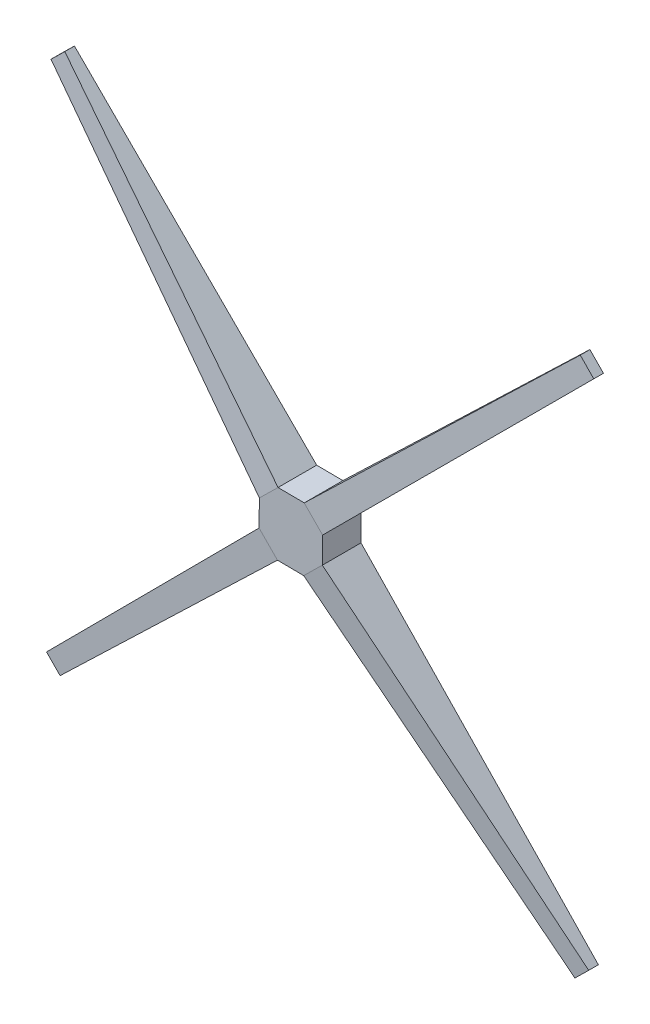
ISO-10303-21;
HEADER;
FILE_DESCRIPTION(('STEP AP214'),'2;1');
FILE_NAME('part.step','',(''),(''),'','','');
FILE_SCHEMA(('AUTOMOTIVE_DESIGN { 1 0 10303 214 1 1 1 1 }'));
ENDSEC;
DATA;
#1=APPLICATION_CONTEXT('core data for automotive mechanical design processes');
#2=APPLICATION_PROTOCOL_DEFINITION('international standard','automotive_design',2000,#1);
#3=PRODUCT_CONTEXT('',#1,'mechanical');
#4=PRODUCT('Part','Part','',(#3));
#5=PRODUCT_RELATED_PRODUCT_CATEGORY('part','',(#4));
#6=PRODUCT_DEFINITION_FORMATION('','',#4);
#7=PRODUCT_DEFINITION_CONTEXT('part definition',#1,'design');
#8=PRODUCT_DEFINITION('design','',#6,#7);
#9=PRODUCT_DEFINITION_SHAPE('','',#8);
#10=(LENGTH_UNIT() NAMED_UNIT(*) SI_UNIT(.MILLI.,.METRE.));
#11=(NAMED_UNIT(*) PLANE_ANGLE_UNIT() SI_UNIT($,.RADIAN.));
#12=(NAMED_UNIT(*) SI_UNIT($,.STERADIAN.) SOLID_ANGLE_UNIT());
#13=UNCERTAINTY_MEASURE_WITH_UNIT(LENGTH_MEASURE(1.E-05),#10,'distance_accuracy_value','');
#14=(GEOMETRIC_REPRESENTATION_CONTEXT(3) GLOBAL_UNCERTAINTY_ASSIGNED_CONTEXT((#13)) GLOBAL_UNIT_ASSIGNED_CONTEXT((#10,
#11,#12)) REPRESENTATION_CONTEXT('',''));
#15=CARTESIAN_POINT('',(0.,0.,0.));
#16=DIRECTION('',(0.,0.,1.));
#17=DIRECTION('',(1.,0.,0.));
#18=AXIS2_PLACEMENT_3D('',#15,#16,#17);
#19=CARTESIAN_POINT('',(-583.133216143367,41.4134818419812,50.8));
#20=DIRECTION('',(-0.00925150475711182,-0.999957203914112,0.));
#21=DIRECTION('',(0.999957203914112,-0.00925150475711182,0.));
#22=AXIS2_PLACEMENT_3D('',#19,#20,#21);
#23=PLANE('',#22);
#24=DIRECTION('',(-0.999957203914112,0.00925150475711182,0.));
#25=VECTOR('',#24,1.);
#26=CARTESIAN_POINT('',(-583.133216143367,41.4134818419812,0.));
#27=LINE('',#26,#25);
#28=CARTESIAN_POINT('',(-583.133216143367,41.4134818419812,0.));
#29=VERTEX_POINT('',#28);
#30=CARTESIAN_POINT('',(-617.573251094452,41.7321176255305,0.));
#31=VERTEX_POINT('',#30);
#32=EDGE_CURVE('E367',#29,#31,#27,.T.);
#33=ORIENTED_EDGE('',*,*,#32,.T.);
#34=DIRECTION('',(0.,0.,1.));
#35=VECTOR('',#34,1.);
#36=CARTESIAN_POINT('',(-617.573251094452,41.7321176255305,0.));
#37=LINE('',#36,#35);
#38=CARTESIAN_POINT('',(-617.573251094452,41.7321176255305,50.8));
#39=VERTEX_POINT('',#38);
#40=EDGE_CURVE('E89',#39,#31,#37,.F.);
#41=ORIENTED_EDGE('',*,*,#40,.F.);
#42=DIRECTION('',(-0.999957203914112,0.00925150475711182,0.));
#43=VECTOR('',#42,1.);
#44=CARTESIAN_POINT('',(-583.133216143367,41.4134818419812,50.8));
#45=LINE('',#44,#43);
#46=CARTESIAN_POINT('',(-583.133216143367,41.4134818419812,50.8));
#47=VERTEX_POINT('',#46);
#48=EDGE_CURVE('E134',#47,#39,#45,.T.);
#49=ORIENTED_EDGE('',*,*,#48,.F.);
#50=DIRECTION('',(0.,0.,1.));
#51=VECTOR('',#50,1.);
#52=CARTESIAN_POINT('',(-583.133216143367,41.4134818419812,50.8));
#53=LINE('',#52,#51);
#54=EDGE_CURVE('E12',#47,#29,#53,.F.);
#55=ORIENTED_EDGE('',*,*,#54,.T.);
#56=EDGE_LOOP('',(#33,#41,#49,#55));
#57=FACE_BOUND('',#56,.T.);
#58=ADVANCED_FACE('F79',(#57),#23,.F.);
#59=CARTESIAN_POINT('',(-642.151342875942,17.6046448905936,50.8));
#60=DIRECTION('',(0.999957203914112,-0.00925150475711144,0.));
#61=DIRECTION('',(0.00925150475711144,0.999957203914112,0.));
#62=AXIS2_PLACEMENT_3D('',#59,#60,#61);
#63=PLANE('',#62);
#64=DIRECTION('',(-0.00925150475711144,-0.999957203914112,0.));
#65=VECTOR('',#64,1.);
#66=CARTESIAN_POINT('',(-642.151342875942,17.6046448905936,0.));
#67=LINE('',#66,#65);
#68=CARTESIAN_POINT('',(-642.151342875942,17.6046448905936,0.));
#69=VERTEX_POINT('',#68);
#70=CARTESIAN_POINT('',(-642.469978659491,-16.835390060491,0.));
#71=VERTEX_POINT('',#70);
#72=EDGE_CURVE('E309',#69,#71,#67,.T.);
#73=ORIENTED_EDGE('',*,*,#72,.T.);
#74=DIRECTION('',(0.,0.,1.));
#75=VECTOR('',#74,1.);
#76=CARTESIAN_POINT('',(-642.469978659491,-16.835390060491,0.));
#77=LINE('',#76,#75);
#78=CARTESIAN_POINT('',(-642.469978659491,-16.835390060491,50.8));
#79=VERTEX_POINT('',#78);
#80=EDGE_CURVE('E383',#79,#71,#77,.F.);
#81=ORIENTED_EDGE('',*,*,#80,.F.);
#82=DIRECTION('',(-0.00925150475711144,-0.999957203914112,0.));
#83=VECTOR('',#82,1.);
#84=CARTESIAN_POINT('',(-642.151342875942,17.6046448905936,50.8));
#85=LINE('',#84,#83);
#86=CARTESIAN_POINT('',(-642.151342875942,17.6046448905936,50.8));
#87=VERTEX_POINT('',#86);
#88=EDGE_CURVE('E373',#87,#79,#85,.T.);
#89=ORIENTED_EDGE('',*,*,#88,.F.);
#90=DIRECTION('',(0.,0.,1.));
#91=VECTOR('',#90,1.);
#92=CARTESIAN_POINT('',(-642.151342875942,17.6046448905936,50.8));
#93=LINE('',#92,#91);
#94=EDGE_CURVE('E219',#87,#69,#93,.F.);
#95=ORIENTED_EDGE('',*,*,#94,.T.);
#96=EDGE_LOOP('',(#73,#81,#89,#95));
#97=FACE_BOUND('',#96,.T.);
#98=ADVANCED_FACE('F381',(#97),#63,.F.);
#99=CARTESIAN_POINT('',(-618.342505924554,-41.4134818419811,50.8));
#100=DIRECTION('',(0.00925150475711182,0.999957203914112,0.));
#101=DIRECTION('',(-0.999957203914112,0.00925150475711182,0.));
#102=AXIS2_PLACEMENT_3D('',#99,#100,#101);
#103=PLANE('',#102);
#104=DIRECTION('',(0.999957203914112,-0.00925150475711182,0.));
#105=VECTOR('',#104,1.);
#106=CARTESIAN_POINT('',(-618.342505924554,-41.4134818419811,0.));
#107=LINE('',#106,#105);
#108=CARTESIAN_POINT('',(-618.342505924554,-41.4134818419811,0.));
#109=VERTEX_POINT('',#108);
#110=CARTESIAN_POINT('',(-583.902470973469,-41.7321176255305,0.));
#111=VERTEX_POINT('',#110);
#112=EDGE_CURVE('E685',#109,#111,#107,.T.);
#113=ORIENTED_EDGE('',*,*,#112,.T.);
#114=DIRECTION('',(0.,0.,1.));
#115=VECTOR('',#114,1.);
#116=CARTESIAN_POINT('',(-583.902470973469,-41.7321176255304,0.));
#117=LINE('',#116,#115);
#118=CARTESIAN_POINT('',(-583.902470973469,-41.7321176255305,50.8));
#119=VERTEX_POINT('',#118);
#120=EDGE_CURVE('E357',#119,#111,#117,.F.);
#121=ORIENTED_EDGE('',*,*,#120,.F.);
#122=DIRECTION('',(0.999957203914112,-0.00925150475711182,0.));
#123=VECTOR('',#122,1.);
#124=CARTESIAN_POINT('',(-618.342505924554,-41.4134818419811,50.8));
#125=LINE('',#124,#123);
#126=CARTESIAN_POINT('',(-618.342505924554,-41.4134818419811,50.8));
#127=VERTEX_POINT('',#126);
#128=EDGE_CURVE('E366',#127,#119,#125,.T.);
#129=ORIENTED_EDGE('',*,*,#128,.F.);
#130=DIRECTION('',(0.,0.,1.));
#131=VECTOR('',#130,1.);
#132=CARTESIAN_POINT('',(-618.342505924554,-41.4134818419811,50.8));
#133=LINE('',#132,#131);
#134=EDGE_CURVE('E362',#127,#109,#133,.F.);
#135=ORIENTED_EDGE('',*,*,#134,.T.);
#136=EDGE_LOOP('',(#113,#121,#129,#135));
#137=FACE_BOUND('',#136,.T.);
#138=ADVANCED_FACE('F643',(#137),#103,.F.);
#139=CARTESIAN_POINT('',(-559.324379191979,-17.6046448905934,50.8));
#140=DIRECTION('',(-0.999957203914112,0.00925150475711149,0.));
#141=DIRECTION('',(-0.00925150475711149,-0.999957203914112,0.));
#142=AXIS2_PLACEMENT_3D('',#139,#140,#141);
#143=PLANE('',#142);
#144=DIRECTION('',(0.00925150475711149,0.999957203914112,0.));
#145=VECTOR('',#144,1.);
#146=CARTESIAN_POINT('',(-559.324379191979,-17.6046448905934,0.));
#147=LINE('',#146,#145);
#148=CARTESIAN_POINT('',(-559.324379191979,-17.6046448905935,0.));
#149=VERTEX_POINT('',#148);
#150=CARTESIAN_POINT('',(-559.00574340843,16.8353900604909,0.));
#151=VERTEX_POINT('',#150);
#152=EDGE_CURVE('E683',#149,#151,#147,.T.);
#153=ORIENTED_EDGE('',*,*,#152,.T.);
#154=DIRECTION('',(0.,0.,1.));
#155=VECTOR('',#154,1.);
#156=CARTESIAN_POINT('',(-559.00574340843,16.8353900604909,0.));
#157=LINE('',#156,#155);
#158=CARTESIAN_POINT('',(-559.00574340843,16.835390060491,50.8));
#159=VERTEX_POINT('',#158);
#160=EDGE_CURVE('E358',#159,#151,#157,.F.);
#161=ORIENTED_EDGE('',*,*,#160,.F.);
#162=DIRECTION('',(0.00925150475711149,0.999957203914112,0.));
#163=VECTOR('',#162,1.);
#164=CARTESIAN_POINT('',(-559.324379191979,-17.6046448905934,50.8));
#165=LINE('',#164,#163);
#166=CARTESIAN_POINT('',(-559.324379191979,-17.6046448905935,50.8));
#167=VERTEX_POINT('',#166);
#168=EDGE_CURVE('E98',#167,#159,#165,.T.);
#169=ORIENTED_EDGE('',*,*,#168,.F.);
#170=DIRECTION('',(0.,0.,1.));
#171=VECTOR('',#170,1.);
#172=CARTESIAN_POINT('',(-559.324379191979,-17.6046448905934,50.8));
#173=LINE('',#172,#171);
#174=EDGE_CURVE('E349',#167,#149,#173,.F.);
#175=ORIENTED_EDGE('',*,*,#174,.T.);
#176=EDGE_LOOP('',(#153,#161,#169,#175));
#177=FACE_BOUND('',#176,.T.);
#178=ADVANCED_FACE('F327',(#177),#143,.F.);
#179=CARTESIAN_POINT('',(0.,0.,50.8));
#180=DIRECTION('',(0.,0.,1.));
#181=DIRECTION('',(1.,0.,0.));
#182=AXIS2_PLACEMENT_3D('',#179,#180,#181);
#183=PLANE('',#182);
#184=DIRECTION('',(-0.700534718034074,0.713618321533942,0.));
#185=VECTOR('',#184,1.);
#186=CARTESIAN_POINT('',(-559.00574340843,16.8353900604911,50.8));
#187=LINE('',#186,#185);
#188=EDGE_CURVE('E372',#159,#47,#187,.T.);
#189=ORIENTED_EDGE('',*,*,#188,.T.);
#190=ORIENTED_EDGE('',*,*,#48,.T.);
#191=DIRECTION('',(-0.713618321533941,-0.700534718034075,0.));
#192=VECTOR('',#191,1.);
#193=CARTESIAN_POINT('',(-617.573251094452,41.7321176255306,50.8));
#194=LINE('',#193,#192);
#195=EDGE_CURVE('E82',#39,#87,#194,.T.);
#196=ORIENTED_EDGE('',*,*,#195,.T.);
#197=ORIENTED_EDGE('',*,*,#88,.T.);
#198=DIRECTION('',(0.700534718034074,-0.713618321533942,0.));
#199=VECTOR('',#198,1.);
#200=CARTESIAN_POINT('',(-642.469978659491,-16.8353900604911,50.8));
#201=LINE('',#200,#199);
#202=EDGE_CURVE('E375',#79,#127,#201,.T.);
#203=ORIENTED_EDGE('',*,*,#202,.T.);
#204=ORIENTED_EDGE('',*,*,#128,.T.);
#205=DIRECTION('',(0.713618321533942,0.700534718034074,0.));
#206=VECTOR('',#205,1.);
#207=CARTESIAN_POINT('',(-583.902470973469,-41.7321176255305,50.8));
#208=LINE('',#207,#206);
#209=EDGE_CURVE('E363',#119,#167,#208,.T.);
#210=ORIENTED_EDGE('',*,*,#209,.T.);
#211=ORIENTED_EDGE('',*,*,#168,.T.);
#212=EDGE_LOOP('',(#189,#190,#196,#197,#203,#204,#210,#211));
#213=FACE_BOUND('',#212,.T.);
#214=ADVANCED_FACE('F325',(#213),#183,.T.);
#215=CARTESIAN_POINT('',(0.,0.,0.));
#216=DIRECTION('',(0.,0.,1.));
#217=DIRECTION('',(1.,0.,0.));
#218=AXIS2_PLACEMENT_3D('',#215,#216,#217);
#219=PLANE('',#218);
#220=ORIENTED_EDGE('',*,*,#32,.F.);
#221=DIRECTION('',(0.721599332229077,0.692310915504407,0.));
#222=VECTOR('',#221,1.);
#223=CARTESIAN_POINT('',(-583.133216143367,41.4134818419811,0.));
#224=LINE('',#223,#222);
#225=CARTESIAN_POINT('',(-258.392192989741,352.97385198095,0.));
#226=VERTEX_POINT('',#225);
#227=EDGE_CURVE('E510',#29,#226,#224,.T.);
#228=ORIENTED_EDGE('',*,*,#227,.T.);
#229=DIRECTION('',(-0.700534718034074,0.713618321533942,0.));
#230=VECTOR('',#229,1.);
#231=CARTESIAN_POINT('',(-258.392192989741,352.97385198095,0.));
#232=LINE('',#231,#230);
#233=CARTESIAN_POINT('',(-240.598611151676,334.847946613988,0.));
#234=VERTEX_POINT('',#233);
#235=EDGE_CURVE('E505',#234,#226,#232,.T.);
#236=ORIENTED_EDGE('',*,*,#235,.F.);
#237=DIRECTION('',(0.7075450463998,0.706668244167732,0.));
#238=VECTOR('',#237,1.);
#239=CARTESIAN_POINT('',(-559.00574340843,16.8353900604909,0.));
#240=LINE('',#239,#238);
#241=EDGE_CURVE('E508',#151,#234,#240,.T.);
#242=ORIENTED_EDGE('',*,*,#241,.F.);
#243=ORIENTED_EDGE('',*,*,#152,.F.);
#244=DIRECTION('',(0.693395816134367,-0.72055689724501,0.));
#245=VECTOR('',#244,1.);
#246=CARTESIAN_POINT('',(-559.324379191979,-17.6046448905934,0.));
#247=LINE('',#246,#245);
#248=CARTESIAN_POINT('',(-247.280799016528,-341.871317265318,0.));
#249=VERTEX_POINT('',#248);
#250=EDGE_CURVE('E287',#149,#249,#247,.T.);
#251=ORIENTED_EDGE('',*,*,#250,.T.);
#252=DIRECTION('',(0.713618321533941,0.700534718034075,0.));
#253=VECTOR('',#252,1.);
#254=CARTESIAN_POINT('',(-247.280799016528,-341.871317265318,0.));
#255=LINE('',#254,#253);
#256=CARTESIAN_POINT('',(-265.40670438349,-359.664899103383,0.));
#257=VERTEX_POINT('',#256);
#258=EDGE_CURVE('E586',#257,#249,#255,.T.);
#259=ORIENTED_EDGE('',*,*,#258,.F.);
#260=DIRECTION('',(0.707732011403588,-0.706480997645819,0.));
#261=VECTOR('',#260,1.);
#262=CARTESIAN_POINT('',(-583.902470973469,-41.7321176255304,0.));
#263=LINE('',#262,#261);
#264=EDGE_CURVE('E237',#111,#257,#263,.T.);
#265=ORIENTED_EDGE('',*,*,#264,.F.);
#266=ORIENTED_EDGE('',*,*,#112,.F.);
#267=DIRECTION('',(-0.719638428667994,-0.694348998691767,0.));
#268=VECTOR('',#267,1.);
#269=CARTESIAN_POINT('',(-618.342505924554,-41.413481841981,0.));
#270=LINE('',#269,#268);
#271=CARTESIAN_POINT('',(-942.191862937023,-353.882171409867,0.));
#272=VERTEX_POINT('',#271);
#273=EDGE_CURVE('E405',#109,#272,#270,.T.);
#274=ORIENTED_EDGE('',*,*,#273,.T.);
#275=DIRECTION('',(0.700534718034074,-0.713618321533942,0.));
#276=VECTOR('',#275,1.);
#277=CARTESIAN_POINT('',(-942.191862937023,-353.882171409867,0.));
#278=LINE('',#277,#276);
#279=CARTESIAN_POINT('',(-959.985444775089,-335.756266042905,0.));
#280=VERTEX_POINT('',#279);
#281=EDGE_CURVE('E427',#280,#272,#278,.T.);
#282=ORIENTED_EDGE('',*,*,#281,.F.);
#283=DIRECTION('',(-0.7055435931574,-0.708666521118746,0.));
#284=VECTOR('',#283,1.);
#285=CARTESIAN_POINT('',(-642.469978659491,-16.835390060491,0.));
#286=LINE('',#285,#284);
#287=EDGE_CURVE('E406',#71,#280,#286,.T.);
#288=ORIENTED_EDGE('',*,*,#287,.F.);
#289=ORIENTED_EDGE('',*,*,#72,.F.);
#290=DIRECTION('',(-0.693265450029443,0.720682326545805,0.));
#291=VECTOR('',#290,1.);
#292=CARTESIAN_POINT('',(-642.151342875941,17.6046448905935,0.));
#293=LINE('',#292,#291);
#294=CARTESIAN_POINT('',(-954.136822407347,341.928352681963,0.));
#295=VERTEX_POINT('',#294);
#296=EDGE_CURVE('E302',#69,#295,#293,.T.);
#297=ORIENTED_EDGE('',*,*,#296,.T.);
#298=DIRECTION('',(-0.713618321533939,-0.700534718034077,0.));
#299=VECTOR('',#298,1.);
#300=CARTESIAN_POINT('',(-954.136822407347,341.928352681963,0.));
#301=LINE('',#300,#299);
#302=CARTESIAN_POINT('',(-936.010917040385,359.721934520029,0.));
#303=VERTEX_POINT('',#302);
#304=EDGE_CURVE('E226',#303,#295,#301,.T.);
#305=ORIENTED_EDGE('',*,*,#304,.F.);
#306=DIRECTION('',(-0.707604191511818,0.70660902071436,0.));
#307=VECTOR('',#306,1.);
#308=CARTESIAN_POINT('',(-617.573251094452,41.7321176255305,0.));
#309=LINE('',#308,#307);
#310=EDGE_CURVE('E221',#31,#303,#309,.T.);
#311=ORIENTED_EDGE('',*,*,#310,.F.);
#312=EDGE_LOOP('',(#220,#228,#236,#242,#243,#251,#259,#265,#266,#274,#282,#288,#289,#297,#305,#311));
#313=FACE_BOUND('',#312,.T.);
#314=ADVANCED_FACE('F305',(#313),#219,.F.);
#315=CARTESIAN_POINT('',(-656.723047739733,-644.682572170968,0.));
#316=DIRECTION('',(0.713618321533942,0.700534718034074,0.));
#317=DIRECTION('',(-0.700534718034074,0.713618321533942,0.));
#318=AXIS2_PLACEMENT_3D('',#315,#316,#317);
#319=PLANE('',#318);
#320=ORIENTED_EDGE('',*,*,#281,.T.);
#321=DIRECTION('',(0.,0.,1.));
#322=VECTOR('',#321,1.);
#323=CARTESIAN_POINT('',(-942.191862937023,-353.882171409867,0.));
#324=LINE('',#323,#322);
#325=CARTESIAN_POINT('',(-942.191862937023,-353.882171409867,12.7));
#326=VERTEX_POINT('',#325);
#327=EDGE_CURVE('E370',#272,#326,#324,.T.);
#328=ORIENTED_EDGE('',*,*,#327,.T.);
#329=DIRECTION('',(-0.700534718034074,0.713618321533942,0.));
#330=VECTOR('',#329,1.);
#331=CARTESIAN_POINT('',(-942.191862937023,-353.882171409867,12.7));
#332=LINE('',#331,#330);
#333=CARTESIAN_POINT('',(-959.985444775089,-335.756266042905,12.7));
#334=VERTEX_POINT('',#333);
#335=EDGE_CURVE('E482',#326,#334,#332,.T.);
#336=ORIENTED_EDGE('',*,*,#335,.T.);
#337=DIRECTION('',(0.,0.,-1.));
#338=VECTOR('',#337,1.);
#339=CARTESIAN_POINT('',(-959.985444775089,-335.756266042905,0.));
#340=LINE('',#339,#338);
#341=EDGE_CURVE('E402',#334,#280,#340,.T.);
#342=ORIENTED_EDGE('',*,*,#341,.T.);
#343=EDGE_LOOP('',(#320,#328,#336,#342));
#344=FACE_BOUND('',#343,.T.);
#345=ADVANCED_FACE('F324',(#344),#319,.F.);
#346=CARTESIAN_POINT('',(-314.236103114604,312.851337948427,0.));
#347=DIRECTION('',(0.708666521118746,-0.7055435931574,0.));
#348=DIRECTION('',(0.7055435931574,0.708666521118746,0.));
#349=AXIS2_PLACEMENT_3D('',#346,#347,#348);
#350=PLANE('',#349);
#351=ORIENTED_EDGE('',*,*,#287,.T.);
#352=ORIENTED_EDGE('',*,*,#341,.F.);
#353=DIRECTION('',(-0.703028611780649,-0.706140407749954,-0.0843593240875107));
#354=VECTOR('',#353,1.);
#355=CARTESIAN_POINT('',(-642.469978659491,-16.835390060491,50.8));
#356=LINE('',#355,#354);
#357=EDGE_CURVE('E396',#79,#334,#356,.T.);
#358=ORIENTED_EDGE('',*,*,#357,.F.);
#359=ORIENTED_EDGE('',*,*,#80,.T.);
#360=EDGE_LOOP('',(#351,#352,#358,#359));
#361=FACE_BOUND('',#360,.T.);
#362=ADVANCED_FACE('F401',(#361),#350,.F.);
#363=CARTESIAN_POINT('',(-5.43604469433919,-5.33637929724648,89.9714179790182));
#364=DIRECTION('',(0.0602042843648167,0.0591004884533979,-0.996434933354251));
#365=DIRECTION('',(-0.998179713115271,0.,-0.0603097034076165));
#366=AXIS2_PLACEMENT_3D('',#363,#364,#365);
#367=PLANE('',#366);
#368=ORIENTED_EDGE('',*,*,#357,.T.);
#369=ORIENTED_EDGE('',*,*,#335,.F.);
#370=DIRECTION('',(-0.717073059831017,-0.691873781676846,-0.0843617039465353));
#371=VECTOR('',#370,1.);
#372=CARTESIAN_POINT('',(-618.342505924554,-41.413481841981,50.8));
#373=LINE('',#372,#371);
#374=EDGE_CURVE('E398',#127,#326,#373,.T.);
#375=ORIENTED_EDGE('',*,*,#374,.F.);
#376=ORIENTED_EDGE('',*,*,#202,.F.);
#377=EDGE_LOOP('',(#368,#369,#375,#376));
#378=FACE_BOUND('',#377,.T.);
#379=ADVANCED_FACE('F394',(#378),#367,.F.);
#380=CARTESIAN_POINT('',(-277.422120089086,287.526328913565,0.));
#381=DIRECTION('',(-0.694348998691767,0.719638428667995,0.));
#382=DIRECTION('',(-0.719638428667995,-0.694348998691767,0.));
#383=AXIS2_PLACEMENT_3D('',#380,#381,#382);
#384=PLANE('',#383);
#385=ORIENTED_EDGE('',*,*,#374,.T.);
#386=ORIENTED_EDGE('',*,*,#327,.F.);
#387=ORIENTED_EDGE('',*,*,#273,.F.);
#388=ORIENTED_EDGE('',*,*,#134,.F.);
#389=EDGE_LOOP('',(#385,#386,#387,#388));
#390=FACE_BOUND('',#389,.T.);
#391=ADVANCED_FACE('F440',(#390),#384,.F.);
#392=CARTESIAN_POINT('',(44.8702040456152,44.0475458528867,0.));
#393=DIRECTION('',(0.713618321533942,0.700534718034074,0.));
#394=DIRECTION('',(-0.700534718034074,0.713618321533942,0.));
#395=AXIS2_PLACEMENT_3D('',#392,#393,#394);
#396=PLANE('',#395);
#397=DIRECTION('',(0.700534718034074,-0.713618321533942,0.));
#398=VECTOR('',#397,1.);
#399=CARTESIAN_POINT('',(-258.392192989741,352.97385198095,12.7));
#400=LINE('',#399,#398);
#401=CARTESIAN_POINT('',(-258.392192989741,352.97385198095,12.7));
#402=VERTEX_POINT('',#401);
#403=CARTESIAN_POINT('',(-240.598611151676,334.847946613988,12.7));
#404=VERTEX_POINT('',#403);
#405=EDGE_CURVE('E525',#402,#404,#400,.T.);
#406=ORIENTED_EDGE('',*,*,#405,.T.);
#407=DIRECTION('',(0.,0.,-1.));
#408=VECTOR('',#407,1.);
#409=CARTESIAN_POINT('',(-240.598611151676,334.847946613988,12.7));
#410=LINE('',#409,#408);
#411=EDGE_CURVE('E516',#404,#234,#410,.T.);
#412=ORIENTED_EDGE('',*,*,#411,.T.);
#413=ORIENTED_EDGE('',*,*,#235,.T.);
#414=DIRECTION('',(0.,0.,1.));
#415=VECTOR('',#414,1.);
#416=CARTESIAN_POINT('',(-258.392192989741,352.97385198095,12.7));
#417=LINE('',#416,#415);
#418=EDGE_CURVE('E411',#226,#402,#417,.T.);
#419=ORIENTED_EDGE('',*,*,#418,.T.);
#420=EDGE_LOOP('',(#406,#412,#413,#419));
#421=FACE_BOUND('',#420,.T.);
#422=ADVANCED_FACE('F449',(#421),#396,.T.);
#423=CARTESIAN_POINT('',(-300.1814655681,312.880730681051,0.));
#424=DIRECTION('',(0.692310915504407,-0.721599332229077,0.));
#425=DIRECTION('',(0.721599332229077,0.692310915504407,0.));
#426=AXIS2_PLACEMENT_3D('',#423,#424,#425);
#427=PLANE('',#426);
#428=DIRECTION('',(0.719027118549253,0.689843103343258,-0.0843593240875107));
#429=VECTOR('',#428,1.);
#430=CARTESIAN_POINT('',(-583.133216143367,41.4134818419811,50.8));
#431=LINE('',#430,#429);
#432=EDGE_CURVE('E582',#47,#402,#431,.T.);
#433=ORIENTED_EDGE('',*,*,#432,.T.);
#434=ORIENTED_EDGE('',*,*,#418,.F.);
#435=ORIENTED_EDGE('',*,*,#227,.F.);
#436=ORIENTED_EDGE('',*,*,#54,.F.);
#437=EDGE_LOOP('',(#433,#434,#435,#436));
#438=FACE_BOUND('',#437,.T.);
#439=ADVANCED_FACE('F546',(#438),#427,.F.);
#440=CARTESIAN_POINT('',(1.0812288302206,1.06140539116311,17.895307431163));
#441=DIRECTION('',(-0.0602042843648166,-0.059100488453398,-0.996434933354251));
#442=DIRECTION('',(-0.998179713115271,0.,0.0603097034076164));
#443=AXIS2_PLACEMENT_3D('',#440,#441,#442);
#444=PLANE('',#443);
#445=DIRECTION('',(0.705022788081617,0.704149111476298,-0.0843617039465353));
#446=VECTOR('',#445,1.);
#447=CARTESIAN_POINT('',(-559.00574340843,16.8353900604909,50.8));
#448=LINE('',#447,#446);
#449=EDGE_CURVE('E526',#159,#404,#448,.T.);
#450=ORIENTED_EDGE('',*,*,#449,.T.);
#451=ORIENTED_EDGE('',*,*,#405,.F.);
#452=ORIENTED_EDGE('',*,*,#432,.F.);
#453=ORIENTED_EDGE('',*,*,#188,.F.);
#454=EDGE_LOOP('',(#450,#451,#452,#453));
#455=FACE_BOUND('',#454,.T.);
#456=ADVANCED_FACE('F664',(#455),#444,.F.);
#457=CARTESIAN_POINT('',(-287.573980791359,287.930789676325,0.));
#458=DIRECTION('',(-0.706668244167732,0.7075450463998,0.));
#459=DIRECTION('',(-0.7075450463998,-0.706668244167732,0.));
#460=AXIS2_PLACEMENT_3D('',#457,#458,#459);
#461=PLANE('',#460);
#462=ORIENTED_EDGE('',*,*,#241,.T.);
#463=ORIENTED_EDGE('',*,*,#411,.F.);
#464=ORIENTED_EDGE('',*,*,#449,.F.);
#465=ORIENTED_EDGE('',*,*,#160,.T.);
#466=EDGE_LOOP('',(#462,#463,#464,#465));
#467=FACE_BOUND('',#466,.T.);
#468=ADVANCED_FACE('F520',(#467),#461,.F.);
#469=CARTESIAN_POINT('',(49.5536198250254,-50.4791127336327,0.));
#470=DIRECTION('',(0.700534718034075,-0.713618321533941,0.));
#471=DIRECTION('',(0.713618321533941,0.700534718034075,0.));
#472=AXIS2_PLACEMENT_3D('',#469,#470,#471);
#473=PLANE('',#472);
#474=DIRECTION('',(0.,0.,1.));
#475=VECTOR('',#474,1.);
#476=CARTESIAN_POINT('',(-247.280799016528,-341.871317265318,0.));
#477=LINE('',#476,#475);
#478=CARTESIAN_POINT('',(-247.280799016528,-341.871317265318,12.7));
#479=VERTEX_POINT('',#478);
#480=EDGE_CURVE('E597',#249,#479,#477,.T.);
#481=ORIENTED_EDGE('',*,*,#480,.T.);
#482=DIRECTION('',(-0.713618321533941,-0.700534718034075,0.));
#483=VECTOR('',#482,1.);
#484=CARTESIAN_POINT('',(-247.280799016528,-341.871317265318,12.7));
#485=LINE('',#484,#483);
#486=CARTESIAN_POINT('',(-265.40670438349,-359.664899103383,12.7));
#487=VERTEX_POINT('',#486);
#488=EDGE_CURVE('E593',#479,#487,#485,.T.);
#489=ORIENTED_EDGE('',*,*,#488,.T.);
#490=DIRECTION('',(0.,0.,-1.));
#491=VECTOR('',#490,1.);
#492=CARTESIAN_POINT('',(-265.40670438349,-359.664899103383,0.));
#493=LINE('',#492,#491);
#494=EDGE_CURVE('E589',#487,#257,#493,.T.);
#495=ORIENTED_EDGE('',*,*,#494,.T.);
#496=ORIENTED_EDGE('',*,*,#258,.T.);
#497=EDGE_LOOP('',(#481,#489,#495,#496));
#498=FACE_BOUND('',#497,.T.);
#499=ADVANCED_FACE('F665',(#498),#473,.T.);
#500=CARTESIAN_POINT('',(-312.300741537777,-312.853753615281,0.));
#501=DIRECTION('',(0.706480997645819,0.707732011403588,0.));
#502=DIRECTION('',(-0.707732011403588,0.706480997645819,0.));
#503=AXIS2_PLACEMENT_3D('',#500,#501,#502);
#504=PLANE('',#503);
#505=ORIENTED_EDGE('',*,*,#264,.T.);
#506=ORIENTED_EDGE('',*,*,#494,.F.);
#507=DIRECTION('',(0.70520915745513,-0.703962603189015,-0.084360521292674));
#508=VECTOR('',#507,1.);
#509=CARTESIAN_POINT('',(-583.902470973469,-41.7321176255304,50.8));
#510=LINE('',#509,#508);
#511=EDGE_CURVE('E601',#119,#487,#510,.T.);
#512=ORIENTED_EDGE('',*,*,#511,.F.);
#513=ORIENTED_EDGE('',*,*,#120,.T.);
#514=EDGE_LOOP('',(#505,#506,#512,#513));
#515=FACE_BOUND('',#514,.T.);
#516=ADVANCED_FACE('F252',(#515),#504,.F.);
#517=CARTESIAN_POINT('',(-299.198300533234,-287.920149786192,0.));
#518=DIRECTION('',(-0.72055689724501,-0.693395816134367,0.));
#519=DIRECTION('',(0.693395816134367,-0.72055689724501,0.));
#520=AXIS2_PLACEMENT_3D('',#517,#518,#519);
#521=PLANE('',#520);
#522=DIRECTION('',(0.690924057518073,-0.717988317109605,-0.0843606735207864));
#523=VECTOR('',#522,1.);
#524=CARTESIAN_POINT('',(-559.324379191979,-17.6046448905934,50.8));
#525=LINE('',#524,#523);
#526=EDGE_CURVE('E605',#167,#479,#525,.T.);
#527=ORIENTED_EDGE('',*,*,#526,.T.);
#528=ORIENTED_EDGE('',*,*,#480,.F.);
#529=ORIENTED_EDGE('',*,*,#250,.F.);
#530=ORIENTED_EDGE('',*,*,#174,.F.);
#531=EDGE_LOOP('',(#527,#528,#529,#530));
#532=FACE_BOUND('',#531,.T.);
#533=ADVANCED_FACE('F749',(#532),#521,.F.);
#534=CARTESIAN_POINT('',(1.10059445194791,-1.12114980923819,18.5560354588528));
#535=DIRECTION('',(-0.0591004884533981,0.0602042843648166,-0.996434933354251));
#536=DIRECTION('',(0.,0.998179713115271,0.0603097034076163));
#537=AXIS2_PLACEMENT_3D('',#534,#535,#536);
#538=PLANE('',#537);
#539=ORIENTED_EDGE('',*,*,#511,.T.);
#540=ORIENTED_EDGE('',*,*,#488,.F.);
#541=ORIENTED_EDGE('',*,*,#526,.F.);
#542=ORIENTED_EDGE('',*,*,#209,.F.);
#543=EDGE_LOOP('',(#539,#540,#541,#542));
#544=FACE_BOUND('',#543,.T.);
#545=ADVANCED_FACE('F249',(#544),#538,.F.);
#546=CARTESIAN_POINT('',(-639.176498198834,651.114139051713,0.));
#547=DIRECTION('',(-0.700534718034077,0.713618321533939,0.));
#548=DIRECTION('',(-0.713618321533939,-0.700534718034077,0.));
#549=AXIS2_PLACEMENT_3D('',#546,#547,#548);
#550=PLANE('',#549);
#551=DIRECTION('',(0.,0.,1.));
#552=VECTOR('',#551,1.);
#553=CARTESIAN_POINT('',(-954.136822407347,341.928352681963,0.));
#554=LINE('',#553,#552);
#555=CARTESIAN_POINT('',(-954.136822407347,341.928352681963,12.7));
#556=VERTEX_POINT('',#555);
#557=EDGE_CURVE('E208',#295,#556,#554,.T.);
#558=ORIENTED_EDGE('',*,*,#557,.T.);
#559=DIRECTION('',(0.713618321533939,0.700534718034077,0.));
#560=VECTOR('',#559,1.);
#561=CARTESIAN_POINT('',(-954.136822407347,341.928352681963,12.7));
#562=LINE('',#561,#560);
#563=CARTESIAN_POINT('',(-936.010917040385,359.721934520029,12.7));
#564=VERTEX_POINT('',#563);
#565=EDGE_CURVE('E194',#556,#564,#562,.T.);
#566=ORIENTED_EDGE('',*,*,#565,.T.);
#567=DIRECTION('',(0.,0.,-1.));
#568=VECTOR('',#567,1.);
#569=CARTESIAN_POINT('',(-936.010917040385,359.721934520029,0.));
#570=LINE('',#569,#568);
#571=EDGE_CURVE('E207',#564,#303,#570,.T.);
#572=ORIENTED_EDGE('',*,*,#571,.T.);
#573=ORIENTED_EDGE('',*,*,#304,.T.);
#574=EDGE_LOOP('',(#558,#566,#572,#573));
#575=FACE_BOUND('',#574,.T.);
#576=ADVANCED_FACE('F224',(#575),#550,.T.);
#577=CARTESIAN_POINT('',(-287.48600613893,-287.890894372168,0.));
#578=DIRECTION('',(-0.70660902071436,-0.707604191511818,0.));
#579=DIRECTION('',(0.707604191511818,-0.70660902071436,0.));
#580=AXIS2_PLACEMENT_3D('',#577,#578,#579);
#581=PLANE('',#580);
#582=ORIENTED_EDGE('',*,*,#310,.T.);
#583=ORIENTED_EDGE('',*,*,#571,.F.);
#584=DIRECTION('',(-0.705081784083625,0.704090160786651,-0.0843606735207864));
#585=VECTOR('',#584,1.);
#586=CARTESIAN_POINT('',(-617.573251094452,41.7321176255305,50.8));
#587=LINE('',#586,#585);
#588=EDGE_CURVE('E201',#39,#564,#587,.T.);
#589=ORIENTED_EDGE('',*,*,#588,.F.);
#590=ORIENTED_EDGE('',*,*,#40,.T.);
#591=EDGE_LOOP('',(#582,#583,#589,#590));
#592=FACE_BOUND('',#591,.T.);
#593=ADVANCED_FACE('F248',(#592),#581,.F.);
#594=CARTESIAN_POINT('',(-324.726795189508,-312.373232298718,0.));
#595=DIRECTION('',(0.720682326545804,0.693265450029443,0.));
#596=DIRECTION('',(-0.693265450029443,0.720682326545804,0.));
#597=AXIS2_PLACEMENT_3D('',#594,#595,#596);
#598=PLANE('',#597);
#599=DIRECTION('',(-0.69079416506599,0.718113308578814,-0.084360521292674));
#600=VECTOR('',#599,1.);
#601=CARTESIAN_POINT('',(-642.151342875941,17.6046448905935,50.8));
#602=LINE('',#601,#600);
#603=EDGE_CURVE('E199',#87,#556,#602,.T.);
#604=ORIENTED_EDGE('',*,*,#603,.T.);
#605=ORIENTED_EDGE('',*,*,#557,.F.);
#606=ORIENTED_EDGE('',*,*,#296,.F.);
#607=ORIENTED_EDGE('',*,*,#94,.F.);
#608=EDGE_LOOP('',(#604,#605,#606,#607));
#609=FACE_BOUND('',#608,.T.);
#610=ADVANCED_FACE('F215',(#609),#598,.F.);
#611=CARTESIAN_POINT('',(-5.29719023646172,5.39612371532156,89.3106899513285));
#612=DIRECTION('',(0.0591004884533982,-0.0602042843648164,-0.996434933354251));
#613=DIRECTION('',(0.,0.998179713115271,-0.0603097034076161));
#614=AXIS2_PLACEMENT_3D('',#611,#612,#613);
#615=PLANE('',#614);
#616=ORIENTED_EDGE('',*,*,#588,.T.);
#617=ORIENTED_EDGE('',*,*,#565,.F.);
#618=ORIENTED_EDGE('',*,*,#603,.F.);
#619=ORIENTED_EDGE('',*,*,#195,.F.);
#620=EDGE_LOOP('',(#616,#617,#618,#619));
#621=FACE_BOUND('',#620,.T.);
#622=ADVANCED_FACE('F197',(#621),#615,.F.);
#623=CLOSED_SHELL('',(#58,#98,#138,#178,#214,#314,#345,#362,#379,#391,#422,#439,#456,#468,#499,
#516,#533,#545,#576,#593,#610,#622));
#624=MANIFOLD_SOLID_BREP('B2',#623);
#625=ADVANCED_BREP_SHAPE_REPRESENTATION('',(#18,#624),#14);
#626=SHAPE_DEFINITION_REPRESENTATION(#9,#625);
ENDSEC;
END-ISO-10303-21;
